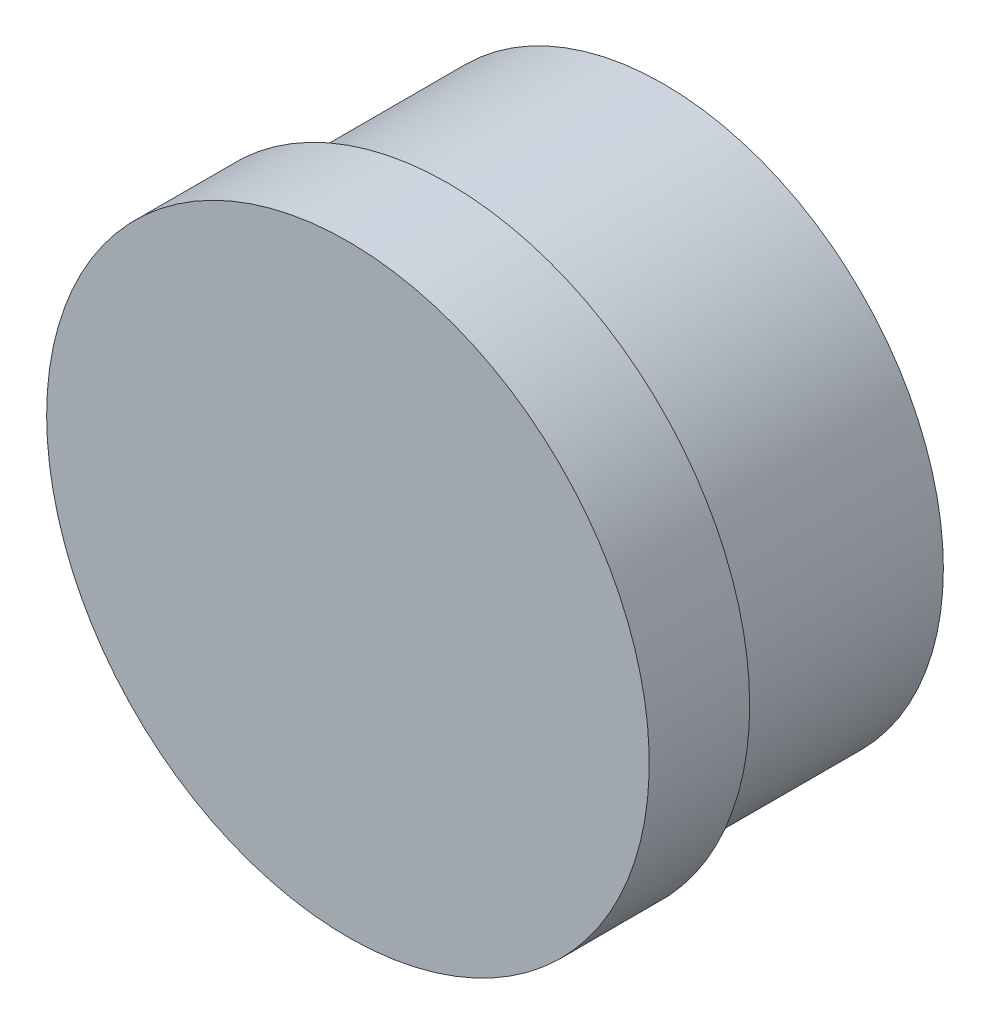
ISO-10303-21;
HEADER;
FILE_DESCRIPTION(('STEP AP214'),'2;1');
FILE_NAME('part.step','',(''),(''),'','','');
FILE_SCHEMA(('AUTOMOTIVE_DESIGN { 1 0 10303 214 1 1 1 1 }'));
ENDSEC;
DATA;
#1=APPLICATION_CONTEXT('core data for automotive mechanical design processes');
#2=APPLICATION_PROTOCOL_DEFINITION('international standard','automotive_design',2000,#1);
#3=PRODUCT_CONTEXT('',#1,'mechanical');
#4=PRODUCT('Part','Part','',(#3));
#5=PRODUCT_RELATED_PRODUCT_CATEGORY('part','',(#4));
#6=PRODUCT_DEFINITION_FORMATION('','',#4);
#7=PRODUCT_DEFINITION_CONTEXT('part definition',#1,'design');
#8=PRODUCT_DEFINITION('design','',#6,#7);
#9=PRODUCT_DEFINITION_SHAPE('','',#8);
#10=(LENGTH_UNIT() NAMED_UNIT(*) SI_UNIT(.MILLI.,.METRE.));
#11=(NAMED_UNIT(*) PLANE_ANGLE_UNIT() SI_UNIT($,.RADIAN.));
#12=(NAMED_UNIT(*) SI_UNIT($,.STERADIAN.) SOLID_ANGLE_UNIT());
#13=UNCERTAINTY_MEASURE_WITH_UNIT(LENGTH_MEASURE(1.E-05),#10,'distance_accuracy_value','');
#14=(GEOMETRIC_REPRESENTATION_CONTEXT(3) GLOBAL_UNCERTAINTY_ASSIGNED_CONTEXT((#13)) GLOBAL_UNIT_ASSIGNED_CONTEXT((#10,
#11,#12)) REPRESENTATION_CONTEXT('',''));
#15=CARTESIAN_POINT('',(0.,0.,0.));
#16=DIRECTION('',(0.,0.,1.));
#17=DIRECTION('',(1.,0.,0.));
#18=AXIS2_PLACEMENT_3D('',#15,#16,#17);
#19=CARTESIAN_POINT('',(0.,0.,22.));
#20=DIRECTION('',(0.,0.,1.));
#21=DIRECTION('',(1.,0.,0.));
#22=AXIS2_PLACEMENT_3D('',#19,#20,#21);
#23=PLANE('',#22);
#24=CARTESIAN_POINT('',(0.,0.,22.));
#25=DIRECTION('',(0.,0.,-1.));
#26=DIRECTION('',(-1.,0.,0.));
#27=AXIS2_PLACEMENT_3D('',#24,#25,#26);
#28=CIRCLE('',#27,21.);
#29=CARTESIAN_POINT('',(-21.,0.,22.));
#30=VERTEX_POINT('',#29);
#31=EDGE_CURVE('E94',#30,#30,#28,.F.);
#32=ORIENTED_EDGE('',*,*,#31,.T.);
#33=EDGE_LOOP('',(#32));
#34=FACE_BOUND('',#33,.T.);
#35=ADVANCED_FACE('F79',(#34),#23,.T.);
#36=CARTESIAN_POINT('',(0.,0.,15.));
#37=DIRECTION('',(0.,0.,-1.));
#38=DIRECTION('',(-1.,0.,0.));
#39=AXIS2_PLACEMENT_3D('',#36,#37,#38);
#40=CYLINDRICAL_SURFACE('',#39,19.5);
#41=CARTESIAN_POINT('',(0.,0.,15.));
#42=DIRECTION('',(0.,0.,1.));
#43=DIRECTION('',(1.,0.,0.));
#44=AXIS2_PLACEMENT_3D('',#41,#42,#43);
#45=CIRCLE('',#44,19.5);
#46=CARTESIAN_POINT('',(19.5,0.,15.));
#47=VERTEX_POINT('',#46);
#48=EDGE_CURVE('E11',#47,#47,#45,.T.);
#49=ORIENTED_EDGE('',*,*,#48,.F.);
#50=EDGE_LOOP('',(#49));
#51=FACE_BOUND('',#50,.T.);
#52=CARTESIAN_POINT('',(0.,0.,0.));
#53=DIRECTION('',(0.,0.,1.));
#54=DIRECTION('',(1.,0.,0.));
#55=AXIS2_PLACEMENT_3D('',#52,#53,#54);
#56=CIRCLE('',#55,19.5);
#57=CARTESIAN_POINT('',(19.5,0.,0.));
#58=VERTEX_POINT('',#57);
#59=EDGE_CURVE('E83',#58,#58,#56,.T.);
#60=ORIENTED_EDGE('',*,*,#59,.T.);
#61=EDGE_LOOP('',(#60));
#62=FACE_BOUND('',#61,.T.);
#63=ADVANCED_FACE('F81',(#51,#62),#40,.T.);
#64=CARTESIAN_POINT('',(0.,0.,0.));
#65=DIRECTION('',(0.,0.,1.));
#66=DIRECTION('',(1.,0.,0.));
#67=AXIS2_PLACEMENT_3D('',#64,#65,#66);
#68=PLANE('',#67);
#69=ORIENTED_EDGE('',*,*,#59,.F.);
#70=EDGE_LOOP('',(#69));
#71=FACE_BOUND('',#70,.T.);
#72=ADVANCED_FACE('F103',(#71),#68,.F.);
#73=CARTESIAN_POINT('',(0.,0.,17.));
#74=DIRECTION('',(0.,0.,-1.));
#75=DIRECTION('',(-1.,0.,0.));
#76=AXIS2_PLACEMENT_3D('',#73,#74,#75);
#77=CYLINDRICAL_SURFACE('',#76,21.);
#78=ORIENTED_EDGE('',*,*,#31,.F.);
#79=EDGE_LOOP('',(#78));
#80=FACE_BOUND('',#79,.T.);
#81=CARTESIAN_POINT('',(0.,0.,15.));
#82=DIRECTION('',(0.,0.,1.));
#83=DIRECTION('',(1.,0.,0.));
#84=AXIS2_PLACEMENT_3D('',#81,#82,#83);
#85=CIRCLE('',#84,21.);
#86=CARTESIAN_POINT('',(21.,0.,15.));
#87=VERTEX_POINT('',#86);
#88=EDGE_CURVE('E90',#87,#87,#85,.T.);
#89=ORIENTED_EDGE('',*,*,#88,.T.);
#90=EDGE_LOOP('',(#89));
#91=FACE_BOUND('',#90,.T.);
#92=ADVANCED_FACE('F99',(#80,#91),#77,.T.);
#93=CARTESIAN_POINT('',(0.,0.,15.));
#94=DIRECTION('',(0.,0.,1.));
#95=DIRECTION('',(1.,0.,0.));
#96=AXIS2_PLACEMENT_3D('',#93,#94,#95);
#97=PLANE('',#96);
#98=ORIENTED_EDGE('',*,*,#48,.T.);
#99=EDGE_LOOP('',(#98));
#100=FACE_BOUND('',#99,.T.);
#101=ORIENTED_EDGE('',*,*,#88,.F.);
#102=EDGE_LOOP('',(#101));
#103=FACE_BOUND('',#102,.T.);
#104=ADVANCED_FACE('F102',(#100,#103),#97,.F.);
#105=CLOSED_SHELL('',(#35,#63,#72,#92,#104));
#106=MANIFOLD_SOLID_BREP('B2',#105);
#107=ADVANCED_BREP_SHAPE_REPRESENTATION('',(#18,#106),#14);
#108=SHAPE_DEFINITION_REPRESENTATION(#9,#107);
ENDSEC;
END-ISO-10303-21;
